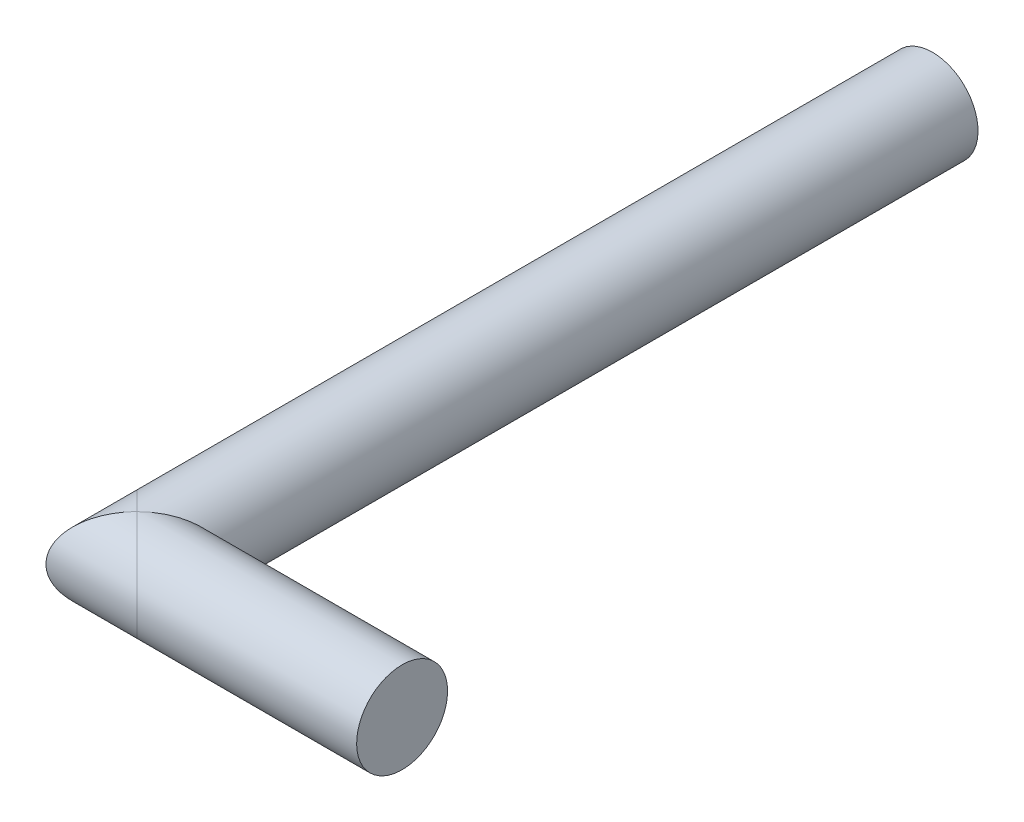
ISO-10303-21;
HEADER;
FILE_DESCRIPTION(('STEP AP214'),'2;1');
FILE_NAME('part.step','',(''),(''),'','','');
FILE_SCHEMA(('AUTOMOTIVE_DESIGN { 1 0 10303 214 1 1 1 1 }'));
ENDSEC;
DATA;
#1=APPLICATION_CONTEXT('core data for automotive mechanical design processes');
#2=APPLICATION_PROTOCOL_DEFINITION('international standard','automotive_design',2000,#1);
#3=PRODUCT_CONTEXT('',#1,'mechanical');
#4=PRODUCT('Part','Part','',(#3));
#5=PRODUCT_RELATED_PRODUCT_CATEGORY('part','',(#4));
#6=PRODUCT_DEFINITION_FORMATION('','',#4);
#7=PRODUCT_DEFINITION_CONTEXT('part definition',#1,'design');
#8=PRODUCT_DEFINITION('design','',#6,#7);
#9=PRODUCT_DEFINITION_SHAPE('','',#8);
#10=(LENGTH_UNIT() NAMED_UNIT(*) SI_UNIT(.MILLI.,.METRE.));
#11=(NAMED_UNIT(*) PLANE_ANGLE_UNIT() SI_UNIT($,.RADIAN.));
#12=(NAMED_UNIT(*) SI_UNIT($,.STERADIAN.) SOLID_ANGLE_UNIT());
#13=UNCERTAINTY_MEASURE_WITH_UNIT(LENGTH_MEASURE(1.E-05),#10,'distance_accuracy_value','');
#14=(GEOMETRIC_REPRESENTATION_CONTEXT(3) GLOBAL_UNCERTAINTY_ASSIGNED_CONTEXT((#13)) GLOBAL_UNIT_ASSIGNED_CONTEXT((#10,
#11,#12)) REPRESENTATION_CONTEXT('',''));
#15=CARTESIAN_POINT('',(0.,0.,0.));
#16=DIRECTION('',(0.,0.,1.));
#17=DIRECTION('',(1.,0.,0.));
#18=AXIS2_PLACEMENT_3D('',#15,#16,#17);
#19=CARTESIAN_POINT('',(-5.,0.,0.95));
#20=DIRECTION('',(0.,0.,-1.));
#21=DIRECTION('',(0.,1.,0.));
#22=AXIS2_PLACEMENT_3D('',#19,#20,#21);
#23=CYLINDRICAL_SURFACE('',#22,0.3);
#24=CARTESIAN_POINT('',(-5.,0.,1.25));
#25=DIRECTION('',(0.707106781186548,0.,-0.707106781186547));
#26=DIRECTION('',(-0.707106781186547,0.,-0.707106781186548));
#27=AXIS2_PLACEMENT_3D('',#24,#25,#26);
#28=ELLIPSE('',#27,0.424264068711929,0.3);
#29=CARTESIAN_POINT('',(-5.,0.3,1.25));
#30=VERTEX_POINT('',#29);
#31=CARTESIAN_POINT('',(-5.,-0.3,1.25));
#32=VERTEX_POINT('',#31);
#33=EDGE_CURVE('E30',#30,#32,#28,.F.);
#34=ORIENTED_EDGE('',*,*,#33,.T.);
#35=CARTESIAN_POINT('',(-5.,0.,1.25));
#36=DIRECTION('',(-0.707106781186547,0.,-0.707106781186548));
#37=DIRECTION('',(0.707106781186548,0.,-0.707106781186547));
#38=AXIS2_PLACEMENT_3D('',#35,#36,#37);
#39=ELLIPSE('',#38,0.424264068711929,0.3);
#40=EDGE_CURVE('E24',#32,#30,#39,.T.);
#41=ORIENTED_EDGE('',*,*,#40,.T.);
#42=EDGE_LOOP('',(#34,#41));
#43=FACE_BOUND('',#42,.T.);
#44=ADVANCED_FACE('F16',(#43),#23,.T.);
#45=CARTESIAN_POINT('',(-5.,0.,1.25));
#46=DIRECTION('',(-0.707106781186547,0.,-0.707106781186548));
#47=DIRECTION('',(0.707106781186548,0.,-0.707106781186547));
#48=AXIS2_PLACEMENT_3D('',#45,#46,#47);
#49=ELLIPSE('',#48,0.424264068711929,0.3);
#50=EDGE_CURVE('E10',#32,#30,#49,.F.);
#51=ORIENTED_EDGE('',*,*,#50,.F.);
#52=ORIENTED_EDGE('',*,*,#33,.F.);
#53=EDGE_LOOP('',(#51,#52));
#54=FACE_BOUND('',#53,.T.);
#55=CARTESIAN_POINT('',(-5.,0.,-4.));
#56=DIRECTION('',(0.,0.,1.));
#57=DIRECTION('',(0.,1.,0.));
#58=AXIS2_PLACEMENT_3D('',#55,#56,#57);
#59=CIRCLE('',#58,0.3);
#60=CARTESIAN_POINT('',(-5.,0.3,-4.));
#61=VERTEX_POINT('',#60);
#62=EDGE_CURVE('E37',#61,#61,#59,.T.);
#63=ORIENTED_EDGE('',*,*,#62,.T.);
#64=EDGE_LOOP('',(#63));
#65=FACE_BOUND('',#64,.T.);
#66=ADVANCED_FACE('F33',(#54,#65),#23,.T.);
#67=CARTESIAN_POINT('',(-5.,0.,-4.));
#68=DIRECTION('',(0.,0.,1.));
#69=DIRECTION('',(1.,0.,0.));
#70=AXIS2_PLACEMENT_3D('',#67,#68,#69);
#71=PLANE('',#70);
#72=ORIENTED_EDGE('',*,*,#62,.F.);
#73=EDGE_LOOP('',(#72));
#74=FACE_BOUND('',#73,.T.);
#75=ADVANCED_FACE('F58',(#74),#71,.F.);
#76=CARTESIAN_POINT('',(-3.4,0.,1.25));
#77=DIRECTION('',(-1.,0.,0.));
#78=DIRECTION('',(0.,1.,0.));
#79=AXIS2_PLACEMENT_3D('',#76,#77,#78);
#80=CYLINDRICAL_SURFACE('',#79,0.3);
#81=CARTESIAN_POINT('',(-3.25,0.,1.25));
#82=DIRECTION('',(1.,0.,0.));
#83=DIRECTION('',(0.,1.,0.));
#84=AXIS2_PLACEMENT_3D('',#81,#82,#83);
#85=CIRCLE('',#84,0.3);
#86=CARTESIAN_POINT('',(-3.25,0.3,1.25));
#87=VERTEX_POINT('',#86);
#88=EDGE_CURVE('E46',#87,#87,#85,.T.);
#89=ORIENTED_EDGE('',*,*,#88,.F.);
#90=EDGE_LOOP('',(#89));
#91=FACE_BOUND('',#90,.T.);
#92=CARTESIAN_POINT('',(-5.,0.,1.25));
#93=DIRECTION('',(0.707106781186548,0.,-0.707106781186547));
#94=DIRECTION('',(-0.707106781186547,0.,-0.707106781186548));
#95=AXIS2_PLACEMENT_3D('',#92,#93,#94);
#96=ELLIPSE('',#95,0.424264068711929,0.3);
#97=EDGE_CURVE('E36',#30,#32,#96,.T.);
#98=ORIENTED_EDGE('',*,*,#97,.T.);
#99=ORIENTED_EDGE('',*,*,#50,.T.);
#100=EDGE_LOOP('',(#98,#99));
#101=FACE_BOUND('',#100,.T.);
#102=ADVANCED_FACE('F41',(#91,#101),#80,.T.);
#103=ORIENTED_EDGE('',*,*,#40,.F.);
#104=ORIENTED_EDGE('',*,*,#97,.F.);
#105=EDGE_LOOP('',(#103,#104));
#106=FACE_BOUND('',#105,.T.);
#107=ADVANCED_FACE('F18',(#106),#80,.T.);
#108=CARTESIAN_POINT('',(-3.25,0.,1.25));
#109=DIRECTION('',(1.,0.,0.));
#110=DIRECTION('',(0.,0.,1.));
#111=AXIS2_PLACEMENT_3D('',#108,#109,#110);
#112=PLANE('',#111);
#113=ORIENTED_EDGE('',*,*,#88,.T.);
#114=EDGE_LOOP('',(#113));
#115=FACE_BOUND('',#114,.T.);
#116=ADVANCED_FACE('F107',(#115),#112,.T.);
#117=CLOSED_SHELL('',(#44,#66,#75,#102,#107,#116));
#118=MANIFOLD_SOLID_BREP('B1',#117);
#119=ADVANCED_BREP_SHAPE_REPRESENTATION('',(#18,#118),#14);
#120=SHAPE_DEFINITION_REPRESENTATION(#9,#119);
ENDSEC;
END-ISO-10303-21;
